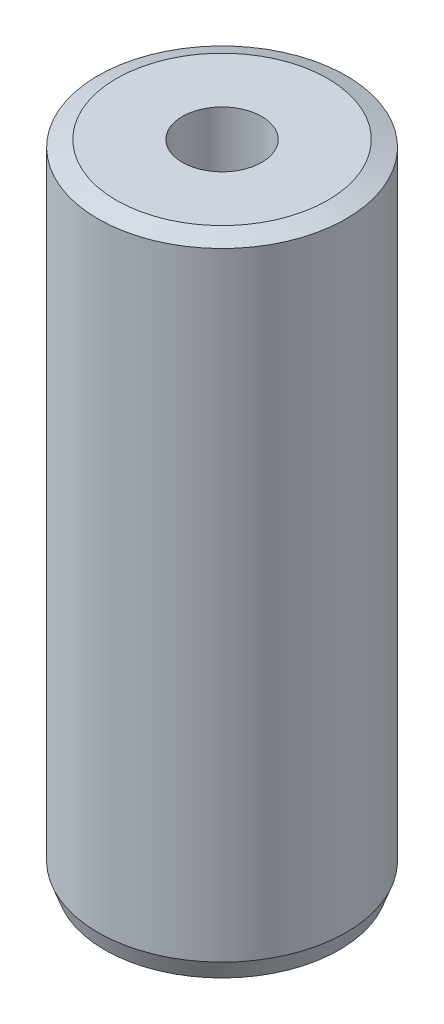
ISO-10303-21;
HEADER;
FILE_DESCRIPTION(('STEP AP214'),'2;1');
FILE_NAME('part.step','',(''),(''),'','','');
FILE_SCHEMA(('AUTOMOTIVE_DESIGN { 1 0 10303 214 1 1 1 1 }'));
ENDSEC;
DATA;
#1=APPLICATION_CONTEXT('core data for automotive mechanical design processes');
#2=APPLICATION_PROTOCOL_DEFINITION('international standard','automotive_design',2000,#1);
#3=PRODUCT_CONTEXT('',#1,'mechanical');
#4=PRODUCT('Part','Part','',(#3));
#5=PRODUCT_RELATED_PRODUCT_CATEGORY('part','',(#4));
#6=PRODUCT_DEFINITION_FORMATION('','',#4);
#7=PRODUCT_DEFINITION_CONTEXT('part definition',#1,'design');
#8=PRODUCT_DEFINITION('design','',#6,#7);
#9=PRODUCT_DEFINITION_SHAPE('','',#8);
#10=(LENGTH_UNIT() NAMED_UNIT(*) SI_UNIT(.MILLI.,.METRE.));
#11=(NAMED_UNIT(*) PLANE_ANGLE_UNIT() SI_UNIT($,.RADIAN.));
#12=(NAMED_UNIT(*) SI_UNIT($,.STERADIAN.) SOLID_ANGLE_UNIT());
#13=UNCERTAINTY_MEASURE_WITH_UNIT(LENGTH_MEASURE(1.E-05),#10,'distance_accuracy_value','');
#14=(GEOMETRIC_REPRESENTATION_CONTEXT(3) GLOBAL_UNCERTAINTY_ASSIGNED_CONTEXT((#13)) GLOBAL_UNIT_ASSIGNED_CONTEXT((#10,
#11,#12)) REPRESENTATION_CONTEXT('',''));
#15=CARTESIAN_POINT('',(0.,0.,0.));
#16=DIRECTION('',(0.,0.,1.));
#17=DIRECTION('',(1.,0.,0.));
#18=AXIS2_PLACEMENT_3D('',#15,#16,#17);
#19=CARTESIAN_POINT('',(0.,64.8104078353087,0.));
#20=DIRECTION('',(0.,-1.,0.));
#21=DIRECTION('',(0.,0.,-1.));
#22=AXIS2_PLACEMENT_3D('',#19,#20,#21);
#23=CYLINDRICAL_SURFACE('',#22,12.5);
#24=CARTESIAN_POINT('',(0.,64.1269700161534,0.));
#25=DIRECTION('',(0.,1.,0.));
#26=DIRECTION('',(0.,0.,1.));
#27=AXIS2_PLACEMENT_3D('',#24,#25,#26);
#28=CIRCLE('',#27,12.5);
#29=CARTESIAN_POINT('',(0.,64.1269700161534,12.5));
#30=VERTEX_POINT('',#29);
#31=EDGE_CURVE('E50',#30,#30,#28,.F.);
#32=ORIENTED_EDGE('',*,*,#31,.T.);
#33=EDGE_LOOP('',(#32));
#34=FACE_BOUND('',#33,.T.);
#35=CARTESIAN_POINT('',(0.,1.86386331446323,0.));
#36=DIRECTION('',(0.,1.,0.));
#37=DIRECTION('',(0.,0.,1.));
#38=AXIS2_PLACEMENT_3D('',#35,#36,#37);
#39=CIRCLE('',#38,12.5);
#40=CARTESIAN_POINT('',(0.,1.86386331446323,12.5));
#41=VERTEX_POINT('',#40);
#42=EDGE_CURVE('E51',#41,#41,#39,.T.);
#43=ORIENTED_EDGE('',*,*,#42,.T.);
#44=EDGE_LOOP('',(#43));
#45=FACE_BOUND('',#44,.T.);
#46=ADVANCED_FACE('F39',(#34,#45),#23,.T.);
#47=CARTESIAN_POINT('',(0.,64.8104078353087,0.));
#48=DIRECTION('',(0.,1.,0.));
#49=DIRECTION('',(0.,0.,1.));
#50=AXIS2_PLACEMENT_3D('',#47,#48,#49);
#51=PLANE('',#50);
#52=CARTESIAN_POINT('',(0.,64.8104078353087,0.));
#53=DIRECTION('',(0.,1.,0.));
#54=DIRECTION('',(0.,0.,1.));
#55=AXIS2_PLACEMENT_3D('',#52,#53,#54);
#56=CIRCLE('',#55,10.6361366855367);
#57=CARTESIAN_POINT('',(0.,64.8104078353087,10.6361366855367));
#58=VERTEX_POINT('',#57);
#59=EDGE_CURVE('E54',#58,#58,#56,.T.);
#60=ORIENTED_EDGE('',*,*,#59,.T.);
#61=EDGE_LOOP('',(#60));
#62=FACE_BOUND('',#61,.T.);
#63=CARTESIAN_POINT('',(0.,64.8104078353087,0.));
#64=DIRECTION('',(0.,1.,0.));
#65=DIRECTION('',(0.,0.,1.));
#66=AXIS2_PLACEMENT_3D('',#63,#64,#65);
#67=CIRCLE('',#66,4.00508903170232);
#68=CARTESIAN_POINT('',(0.,64.8104078353087,4.00508903170232));
#69=VERTEX_POINT('',#68);
#70=EDGE_CURVE('E58',#69,#69,#67,.T.);
#71=ORIENTED_EDGE('',*,*,#70,.F.);
#72=EDGE_LOOP('',(#71));
#73=FACE_BOUND('',#72,.T.);
#74=ADVANCED_FACE('F69',(#62,#73),#51,.T.);
#75=CARTESIAN_POINT('',(0.,0.,0.));
#76=DIRECTION('',(0.,1.,0.));
#77=DIRECTION('',(0.,0.,1.));
#78=AXIS2_PLACEMENT_3D('',#75,#76,#77);
#79=PLANE('',#78);
#80=CARTESIAN_POINT('',(0.,0.,0.));
#81=DIRECTION('',(0.,1.,0.));
#82=DIRECTION('',(0.,0.,1.));
#83=AXIS2_PLACEMENT_3D('',#80,#81,#82);
#84=CIRCLE('',#83,11.8165621808447);
#85=CARTESIAN_POINT('',(0.,0.,11.8165621808447));
#86=VERTEX_POINT('',#85);
#87=EDGE_CURVE('E10',#86,#86,#84,.F.);
#88=ORIENTED_EDGE('',*,*,#87,.T.);
#89=EDGE_LOOP('',(#88));
#90=FACE_BOUND('',#89,.T.);
#91=CARTESIAN_POINT('',(0.,0.,0.));
#92=DIRECTION('',(0.,1.,0.));
#93=DIRECTION('',(0.,0.,1.));
#94=AXIS2_PLACEMENT_3D('',#91,#92,#93);
#95=CIRCLE('',#94,4.00508903170232);
#96=CARTESIAN_POINT('',(0.,0.,4.00508903170232));
#97=VERTEX_POINT('',#96);
#98=EDGE_CURVE('E63',#97,#97,#95,.T.);
#99=ORIENTED_EDGE('',*,*,#98,.T.);
#100=EDGE_LOOP('',(#99));
#101=FACE_BOUND('',#100,.T.);
#102=ADVANCED_FACE('F75',(#90,#101),#79,.F.);
#103=CARTESIAN_POINT('',(0.,64.8104078353087,0.));
#104=DIRECTION('',(0.,-1.,0.));
#105=DIRECTION('',(0.,0.,-1.));
#106=AXIS2_PLACEMENT_3D('',#103,#104,#105);
#107=CYLINDRICAL_SURFACE('',#106,4.00508903170232);
#108=ORIENTED_EDGE('',*,*,#70,.T.);
#109=EDGE_LOOP('',(#108));
#110=FACE_BOUND('',#109,.T.);
#111=ORIENTED_EDGE('',*,*,#98,.F.);
#112=EDGE_LOOP('',(#111));
#113=FACE_BOUND('',#112,.T.);
#114=ADVANCED_FACE('F70',(#110,#113),#107,.F.);
#115=CARTESIAN_POINT('',(0.,64.8104078353087,0.));
#116=DIRECTION('',(0.,-1.,0.));
#117=DIRECTION('',(0.,0.,-1.));
#118=AXIS2_PLACEMENT_3D('',#115,#116,#117);
#119=CONICAL_SURFACE('',#118,10.6361366855367,1.21934147322666);
#120=ORIENTED_EDGE('',*,*,#31,.F.);
#121=EDGE_LOOP('',(#120));
#122=FACE_BOUND('',#121,.T.);
#123=ORIENTED_EDGE('',*,*,#59,.F.);
#124=EDGE_LOOP('',(#123));
#125=FACE_BOUND('',#124,.T.);
#126=ADVANCED_FACE('F81',(#122,#125),#119,.T.);
#127=CARTESIAN_POINT('',(0.,1.86386331446323,0.));
#128=DIRECTION('',(0.,1.,0.));
#129=DIRECTION('',(0.,0.,1.));
#130=AXIS2_PLACEMENT_3D('',#127,#128,#129);
#131=CONICAL_SURFACE('',#130,12.5,0.351454853568232);
#132=ORIENTED_EDGE('',*,*,#87,.F.);
#133=EDGE_LOOP('',(#132));
#134=FACE_BOUND('',#133,.T.);
#135=ORIENTED_EDGE('',*,*,#42,.F.);
#136=EDGE_LOOP('',(#135));
#137=FACE_BOUND('',#136,.T.);
#138=ADVANCED_FACE('F45',(#134,#137),#131,.T.);
#139=CLOSED_SHELL('',(#46,#74,#102,#114,#126,#138));
#140=MANIFOLD_SOLID_BREP('B2',#139);
#141=ADVANCED_BREP_SHAPE_REPRESENTATION('',(#18,#140),#14);
#142=SHAPE_DEFINITION_REPRESENTATION(#9,#141);
ENDSEC;
END-ISO-10303-21;
